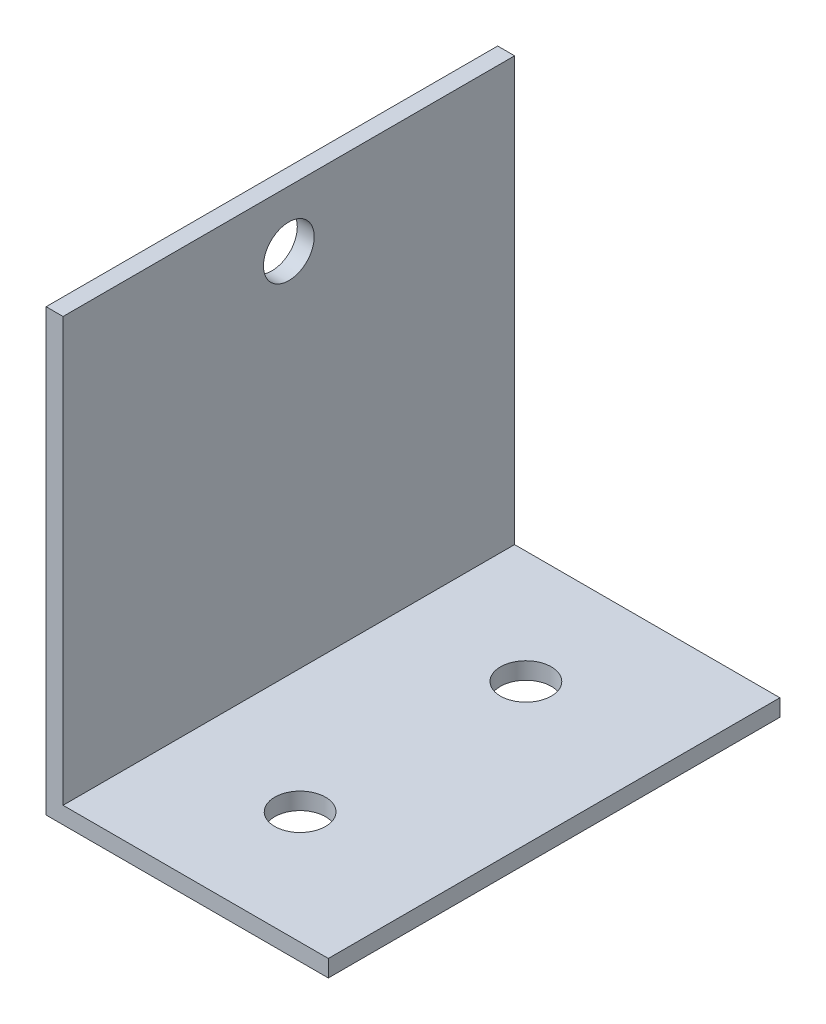
ISO-10303-21;
HEADER;
FILE_DESCRIPTION(('STEP AP214'),'2;1');
FILE_NAME('part.step','',(''),(''),'','','');
FILE_SCHEMA(('AUTOMOTIVE_DESIGN { 1 0 10303 214 1 1 1 1 }'));
ENDSEC;
DATA;
#1=APPLICATION_CONTEXT('core data for automotive mechanical design processes');
#2=APPLICATION_PROTOCOL_DEFINITION('international standard','automotive_design',2000,#1);
#3=PRODUCT_CONTEXT('',#1,'mechanical');
#4=PRODUCT('Part','Part','',(#3));
#5=PRODUCT_RELATED_PRODUCT_CATEGORY('part','',(#4));
#6=PRODUCT_DEFINITION_FORMATION('','',#4);
#7=PRODUCT_DEFINITION_CONTEXT('part definition',#1,'design');
#8=PRODUCT_DEFINITION('design','',#6,#7);
#9=PRODUCT_DEFINITION_SHAPE('','',#8);
#10=(LENGTH_UNIT() NAMED_UNIT(*) SI_UNIT(.MILLI.,.METRE.));
#11=(NAMED_UNIT(*) PLANE_ANGLE_UNIT() SI_UNIT($,.RADIAN.));
#12=(NAMED_UNIT(*) SI_UNIT($,.STERADIAN.) SOLID_ANGLE_UNIT());
#13=UNCERTAINTY_MEASURE_WITH_UNIT(LENGTH_MEASURE(1.E-05),#10,'distance_accuracy_value','');
#14=(GEOMETRIC_REPRESENTATION_CONTEXT(3) GLOBAL_UNCERTAINTY_ASSIGNED_CONTEXT((#13)) GLOBAL_UNIT_ASSIGNED_CONTEXT((#10,
#11,#12)) REPRESENTATION_CONTEXT('',''));
#15=CARTESIAN_POINT('',(0.,0.,0.));
#16=DIRECTION('',(0.,0.,1.));
#17=DIRECTION('',(1.,0.,0.));
#18=AXIS2_PLACEMENT_3D('',#15,#16,#17);
#19=CARTESIAN_POINT('',(1.5,0.,-40.));
#20=DIRECTION('',(1.,0.,0.));
#21=DIRECTION('',(0.,0.,-1.));
#22=AXIS2_PLACEMENT_3D('',#19,#20,#21);
#23=PLANE('',#22);
#24=CARTESIAN_POINT('',(1.5,34.,-20.));
#25=DIRECTION('',(1.,0.,0.));
#26=DIRECTION('',(0.,0.,-1.));
#27=AXIS2_PLACEMENT_3D('',#24,#25,#26);
#28=CIRCLE('',#27,2.25);
#29=CARTESIAN_POINT('',(1.5,34.,-22.25));
#30=VERTEX_POINT('',#29);
#31=EDGE_CURVE('E186',#30,#30,#28,.T.);
#32=ORIENTED_EDGE('',*,*,#31,.F.);
#33=EDGE_LOOP('',(#32));
#34=FACE_BOUND('',#33,.T.);
#35=DIRECTION('',(0.,1.,0.));
#36=VECTOR('',#35,1.);
#37=CARTESIAN_POINT('',(1.5,0.,0.));
#38=LINE('',#37,#36);
#39=CARTESIAN_POINT('',(1.5,1.5,0.));
#40=VERTEX_POINT('',#39);
#41=CARTESIAN_POINT('',(1.5,39.,0.));
#42=VERTEX_POINT('',#41);
#43=EDGE_CURVE('E112',#40,#42,#38,.T.);
#44=ORIENTED_EDGE('',*,*,#43,.F.);
#45=DIRECTION('',(0.,0.,1.));
#46=VECTOR('',#45,1.);
#47=CARTESIAN_POINT('',(1.5,1.5,-40.));
#48=LINE('',#47,#46);
#49=CARTESIAN_POINT('',(1.5,1.5,-40.));
#50=VERTEX_POINT('',#49);
#51=EDGE_CURVE('E11',#50,#40,#48,.T.);
#52=ORIENTED_EDGE('',*,*,#51,.F.);
#53=DIRECTION('',(0.,1.,0.));
#54=VECTOR('',#53,1.);
#55=CARTESIAN_POINT('',(1.5,0.,-40.));
#56=LINE('',#55,#54);
#57=CARTESIAN_POINT('',(1.5,39.,-40.));
#58=VERTEX_POINT('',#57);
#59=EDGE_CURVE('E126',#50,#58,#56,.T.);
#60=ORIENTED_EDGE('',*,*,#59,.T.);
#61=DIRECTION('',(0.,0.,1.));
#62=VECTOR('',#61,1.);
#63=CARTESIAN_POINT('',(1.5,39.,-40.));
#64=LINE('',#63,#62);
#65=EDGE_CURVE('E33',#58,#42,#64,.T.);
#66=ORIENTED_EDGE('',*,*,#65,.T.);
#67=EDGE_LOOP('',(#44,#52,#60,#66));
#68=FACE_BOUND('',#67,.T.);
#69=ADVANCED_FACE('F30',(#34,#68),#23,.T.);
#70=CARTESIAN_POINT('',(0.,1.5,-40.));
#71=DIRECTION('',(0.,1.,0.));
#72=DIRECTION('',(0.,0.,1.));
#73=AXIS2_PLACEMENT_3D('',#70,#71,#72);
#74=PLANE('',#73);
#75=CARTESIAN_POINT('',(12.5,1.5,-10.));
#76=DIRECTION('',(0.,1.,0.));
#77=DIRECTION('',(0.,0.,1.));
#78=AXIS2_PLACEMENT_3D('',#75,#76,#77);
#79=CIRCLE('',#78,2.25);
#80=CARTESIAN_POINT('',(12.5,1.5,-7.75));
#81=VERTEX_POINT('',#80);
#82=EDGE_CURVE('E188',#81,#81,#79,.T.);
#83=ORIENTED_EDGE('',*,*,#82,.F.);
#84=EDGE_LOOP('',(#83));
#85=FACE_BOUND('',#84,.T.);
#86=CARTESIAN_POINT('',(12.5,1.5,-30.));
#87=DIRECTION('',(0.,1.,0.));
#88=DIRECTION('',(0.,0.,1.));
#89=AXIS2_PLACEMENT_3D('',#86,#87,#88);
#90=CIRCLE('',#89,2.25);
#91=CARTESIAN_POINT('',(12.5,1.5,-27.75));
#92=VERTEX_POINT('',#91);
#93=EDGE_CURVE('E196',#92,#92,#90,.T.);
#94=ORIENTED_EDGE('',*,*,#93,.F.);
#95=EDGE_LOOP('',(#94));
#96=FACE_BOUND('',#95,.T.);
#97=DIRECTION('',(1.,0.,0.));
#98=VECTOR('',#97,1.);
#99=CARTESIAN_POINT('',(0.,1.5,0.));
#100=LINE('',#99,#98);
#101=CARTESIAN_POINT('',(25.,1.5,0.));
#102=VERTEX_POINT('',#101);
#103=EDGE_CURVE('E124',#102,#40,#100,.F.);
#104=ORIENTED_EDGE('',*,*,#103,.F.);
#105=DIRECTION('',(0.,0.,1.));
#106=VECTOR('',#105,1.);
#107=CARTESIAN_POINT('',(25.,1.5,-40.));
#108=LINE('',#107,#106);
#109=CARTESIAN_POINT('',(25.,1.5,-40.));
#110=VERTEX_POINT('',#109);
#111=EDGE_CURVE('E39',#110,#102,#108,.T.);
#112=ORIENTED_EDGE('',*,*,#111,.F.);
#113=DIRECTION('',(1.,0.,0.));
#114=VECTOR('',#113,1.);
#115=CARTESIAN_POINT('',(0.,1.5,-40.));
#116=LINE('',#115,#114);
#117=EDGE_CURVE('E93',#110,#50,#116,.F.);
#118=ORIENTED_EDGE('',*,*,#117,.T.);
#119=ORIENTED_EDGE('',*,*,#51,.T.);
#120=EDGE_LOOP('',(#104,#112,#118,#119));
#121=FACE_BOUND('',#120,.T.);
#122=ADVANCED_FACE('F138',(#85,#96,#121),#74,.T.);
#123=CARTESIAN_POINT('',(25.,1.5,-40.));
#124=DIRECTION('',(-1.,0.,0.));
#125=DIRECTION('',(0.,0.,1.));
#126=AXIS2_PLACEMENT_3D('',#123,#124,#125);
#127=PLANE('',#126);
#128=DIRECTION('',(0.,-1.,0.));
#129=VECTOR('',#128,1.);
#130=CARTESIAN_POINT('',(25.,1.5,0.));
#131=LINE('',#130,#129);
#132=CARTESIAN_POINT('',(25.,0.,0.));
#133=VERTEX_POINT('',#132);
#134=EDGE_CURVE('E98',#102,#133,#131,.T.);
#135=ORIENTED_EDGE('',*,*,#134,.T.);
#136=DIRECTION('',(0.,0.,1.));
#137=VECTOR('',#136,1.);
#138=CARTESIAN_POINT('',(25.,0.,-40.));
#139=LINE('',#138,#137);
#140=CARTESIAN_POINT('',(25.,0.,-40.));
#141=VERTEX_POINT('',#140);
#142=EDGE_CURVE('E96',#141,#133,#139,.T.);
#143=ORIENTED_EDGE('',*,*,#142,.F.);
#144=DIRECTION('',(0.,-1.,0.));
#145=VECTOR('',#144,1.);
#146=CARTESIAN_POINT('',(25.,1.5,-40.));
#147=LINE('',#146,#145);
#148=EDGE_CURVE('E87',#110,#141,#147,.T.);
#149=ORIENTED_EDGE('',*,*,#148,.F.);
#150=ORIENTED_EDGE('',*,*,#111,.T.);
#151=EDGE_LOOP('',(#135,#143,#149,#150));
#152=FACE_BOUND('',#151,.T.);
#153=ADVANCED_FACE('F97',(#152),#127,.F.);
#154=CARTESIAN_POINT('',(0.,0.,-40.));
#155=DIRECTION('',(0.,1.,0.));
#156=DIRECTION('',(0.,0.,1.));
#157=AXIS2_PLACEMENT_3D('',#154,#155,#156);
#158=PLANE('',#157);
#159=CARTESIAN_POINT('',(12.5,0.,-10.));
#160=DIRECTION('',(0.,1.,0.));
#161=DIRECTION('',(0.,0.,1.));
#162=AXIS2_PLACEMENT_3D('',#159,#160,#161);
#163=CIRCLE('',#162,2.25);
#164=CARTESIAN_POINT('',(12.5,0.,-7.75));
#165=VERTEX_POINT('',#164);
#166=EDGE_CURVE('E193',#165,#165,#163,.T.);
#167=ORIENTED_EDGE('',*,*,#166,.T.);
#168=EDGE_LOOP('',(#167));
#169=FACE_BOUND('',#168,.T.);
#170=CARTESIAN_POINT('',(12.5,0.,-30.));
#171=DIRECTION('',(0.,1.,0.));
#172=DIRECTION('',(0.,0.,1.));
#173=AXIS2_PLACEMENT_3D('',#170,#171,#172);
#174=CIRCLE('',#173,2.25);
#175=CARTESIAN_POINT('',(12.5,0.,-27.75));
#176=VERTEX_POINT('',#175);
#177=EDGE_CURVE('E116',#176,#176,#174,.T.);
#178=ORIENTED_EDGE('',*,*,#177,.T.);
#179=EDGE_LOOP('',(#178));
#180=FACE_BOUND('',#179,.T.);
#181=DIRECTION('',(-1.,0.,0.));
#182=VECTOR('',#181,1.);
#183=CARTESIAN_POINT('',(0.,0.,0.));
#184=LINE('',#183,#182);
#185=CARTESIAN_POINT('',(0.,0.,0.));
#186=VERTEX_POINT('',#185);
#187=EDGE_CURVE('E121',#133,#186,#184,.T.);
#188=ORIENTED_EDGE('',*,*,#187,.T.);
#189=DIRECTION('',(0.,0.,1.));
#190=VECTOR('',#189,1.);
#191=CARTESIAN_POINT('',(0.,0.,-40.));
#192=LINE('',#191,#190);
#193=CARTESIAN_POINT('',(0.,0.,-40.));
#194=VERTEX_POINT('',#193);
#195=EDGE_CURVE('E101',#194,#186,#192,.T.);
#196=ORIENTED_EDGE('',*,*,#195,.F.);
#197=DIRECTION('',(-1.,0.,0.));
#198=VECTOR('',#197,1.);
#199=CARTESIAN_POINT('',(0.,0.,-40.));
#200=LINE('',#199,#198);
#201=EDGE_CURVE('E91',#141,#194,#200,.T.);
#202=ORIENTED_EDGE('',*,*,#201,.F.);
#203=ORIENTED_EDGE('',*,*,#142,.T.);
#204=EDGE_LOOP('',(#188,#196,#202,#203));
#205=FACE_BOUND('',#204,.T.);
#206=ADVANCED_FACE('F103',(#169,#180,#205),#158,.F.);
#207=CARTESIAN_POINT('',(0.,0.,-40.));
#208=DIRECTION('',(1.,0.,0.));
#209=DIRECTION('',(0.,0.,-1.));
#210=AXIS2_PLACEMENT_3D('',#207,#208,#209);
#211=PLANE('',#210);
#212=CARTESIAN_POINT('',(0.,34.,-20.));
#213=DIRECTION('',(1.,0.,0.));
#214=DIRECTION('',(0.,0.,-1.));
#215=AXIS2_PLACEMENT_3D('',#212,#213,#214);
#216=CIRCLE('',#215,2.25);
#217=CARTESIAN_POINT('',(0.,34.,-22.25));
#218=VERTEX_POINT('',#217);
#219=EDGE_CURVE('E183',#218,#218,#216,.T.);
#220=ORIENTED_EDGE('',*,*,#219,.T.);
#221=EDGE_LOOP('',(#220));
#222=FACE_BOUND('',#221,.T.);
#223=DIRECTION('',(0.,1.,0.));
#224=VECTOR('',#223,1.);
#225=CARTESIAN_POINT('',(0.,0.,0.));
#226=LINE('',#225,#224);
#227=CARTESIAN_POINT('',(0.,39.,0.));
#228=VERTEX_POINT('',#227);
#229=EDGE_CURVE('E119',#186,#228,#226,.T.);
#230=ORIENTED_EDGE('',*,*,#229,.T.);
#231=DIRECTION('',(0.,0.,1.));
#232=VECTOR('',#231,1.);
#233=CARTESIAN_POINT('',(0.,39.,-40.));
#234=LINE('',#233,#232);
#235=CARTESIAN_POINT('',(0.,39.,-40.));
#236=VERTEX_POINT('',#235);
#237=EDGE_CURVE('E129',#236,#228,#234,.T.);
#238=ORIENTED_EDGE('',*,*,#237,.F.);
#239=DIRECTION('',(0.,1.,0.));
#240=VECTOR('',#239,1.);
#241=CARTESIAN_POINT('',(0.,0.,-40.));
#242=LINE('',#241,#240);
#243=EDGE_CURVE('E106',#194,#236,#242,.T.);
#244=ORIENTED_EDGE('',*,*,#243,.F.);
#245=ORIENTED_EDGE('',*,*,#195,.T.);
#246=EDGE_LOOP('',(#230,#238,#244,#245));
#247=FACE_BOUND('',#246,.T.);
#248=ADVANCED_FACE('F155',(#222,#247),#211,.F.);
#249=CARTESIAN_POINT('',(0.,39.,-40.));
#250=DIRECTION('',(0.,-1.,0.));
#251=DIRECTION('',(0.,0.,-1.));
#252=AXIS2_PLACEMENT_3D('',#249,#250,#251);
#253=PLANE('',#252);
#254=DIRECTION('',(1.,0.,0.));
#255=VECTOR('',#254,1.);
#256=CARTESIAN_POINT('',(0.,39.,0.));
#257=LINE('',#256,#255);
#258=EDGE_CURVE('E115',#228,#42,#257,.T.);
#259=ORIENTED_EDGE('',*,*,#258,.T.);
#260=ORIENTED_EDGE('',*,*,#65,.F.);
#261=DIRECTION('',(1.,0.,0.));
#262=VECTOR('',#261,1.);
#263=CARTESIAN_POINT('',(0.,39.,-40.));
#264=LINE('',#263,#262);
#265=EDGE_CURVE('E79',#236,#58,#264,.T.);
#266=ORIENTED_EDGE('',*,*,#265,.F.);
#267=ORIENTED_EDGE('',*,*,#237,.T.);
#268=EDGE_LOOP('',(#259,#260,#266,#267));
#269=FACE_BOUND('',#268,.T.);
#270=ADVANCED_FACE('F134',(#269),#253,.F.);
#271=CARTESIAN_POINT('',(1.5,39.,-40.));
#272=DIRECTION('',(0.,0.,-1.));
#273=DIRECTION('',(-1.,0.,0.));
#274=AXIS2_PLACEMENT_3D('',#271,#272,#273);
#275=PLANE('',#274);
#276=ORIENTED_EDGE('',*,*,#59,.F.);
#277=ORIENTED_EDGE('',*,*,#117,.F.);
#278=ORIENTED_EDGE('',*,*,#148,.T.);
#279=ORIENTED_EDGE('',*,*,#201,.T.);
#280=ORIENTED_EDGE('',*,*,#243,.T.);
#281=ORIENTED_EDGE('',*,*,#265,.T.);
#282=EDGE_LOOP('',(#276,#277,#278,#279,#280,#281));
#283=FACE_BOUND('',#282,.T.);
#284=ADVANCED_FACE('F89',(#283),#275,.T.);
#285=CARTESIAN_POINT('',(1.5,39.,0.));
#286=DIRECTION('',(0.,0.,-1.));
#287=DIRECTION('',(-1.,0.,0.));
#288=AXIS2_PLACEMENT_3D('',#285,#286,#287);
#289=PLANE('',#288);
#290=ORIENTED_EDGE('',*,*,#43,.T.);
#291=ORIENTED_EDGE('',*,*,#258,.F.);
#292=ORIENTED_EDGE('',*,*,#229,.F.);
#293=ORIENTED_EDGE('',*,*,#187,.F.);
#294=ORIENTED_EDGE('',*,*,#134,.F.);
#295=ORIENTED_EDGE('',*,*,#103,.T.);
#296=EDGE_LOOP('',(#290,#291,#292,#293,#294,#295));
#297=FACE_BOUND('',#296,.T.);
#298=ADVANCED_FACE('F137',(#297),#289,.F.);
#299=CARTESIAN_POINT('',(12.5,1.5,-30.));
#300=DIRECTION('',(0.,1.,0.));
#301=DIRECTION('',(0.,0.,1.));
#302=AXIS2_PLACEMENT_3D('',#299,#300,#301);
#303=CYLINDRICAL_SURFACE('',#302,2.25);
#304=ORIENTED_EDGE('',*,*,#177,.F.);
#305=EDGE_LOOP('',(#304));
#306=FACE_BOUND('',#305,.T.);
#307=ORIENTED_EDGE('',*,*,#93,.T.);
#308=EDGE_LOOP('',(#307));
#309=FACE_BOUND('',#308,.T.);
#310=ADVANCED_FACE('F166',(#306,#309),#303,.F.);
#311=CARTESIAN_POINT('',(12.5,1.5,-10.));
#312=DIRECTION('',(0.,1.,0.));
#313=DIRECTION('',(0.,0.,1.));
#314=AXIS2_PLACEMENT_3D('',#311,#312,#313);
#315=CYLINDRICAL_SURFACE('',#314,2.25);
#316=ORIENTED_EDGE('',*,*,#166,.F.);
#317=EDGE_LOOP('',(#316));
#318=FACE_BOUND('',#317,.T.);
#319=ORIENTED_EDGE('',*,*,#82,.T.);
#320=EDGE_LOOP('',(#319));
#321=FACE_BOUND('',#320,.T.);
#322=ADVANCED_FACE('F170',(#318,#321),#315,.F.);
#323=CARTESIAN_POINT('',(1.5,34.,-20.));
#324=DIRECTION('',(1.,0.,0.));
#325=DIRECTION('',(0.,0.,-1.));
#326=AXIS2_PLACEMENT_3D('',#323,#324,#325);
#327=CYLINDRICAL_SURFACE('',#326,2.25);
#328=ORIENTED_EDGE('',*,*,#219,.F.);
#329=EDGE_LOOP('',(#328));
#330=FACE_BOUND('',#329,.T.);
#331=ORIENTED_EDGE('',*,*,#31,.T.);
#332=EDGE_LOOP('',(#331));
#333=FACE_BOUND('',#332,.T.);
#334=ADVANCED_FACE('F174',(#330,#333),#327,.F.);
#335=CLOSED_SHELL('',(#69,#122,#153,#206,#248,#270,#284,#298,#310,#322,#334));
#336=MANIFOLD_SOLID_BREP('B2',#335);
#337=ADVANCED_BREP_SHAPE_REPRESENTATION('',(#18,#336),#14);
#338=SHAPE_DEFINITION_REPRESENTATION(#9,#337);
ENDSEC;
END-ISO-10303-21;
